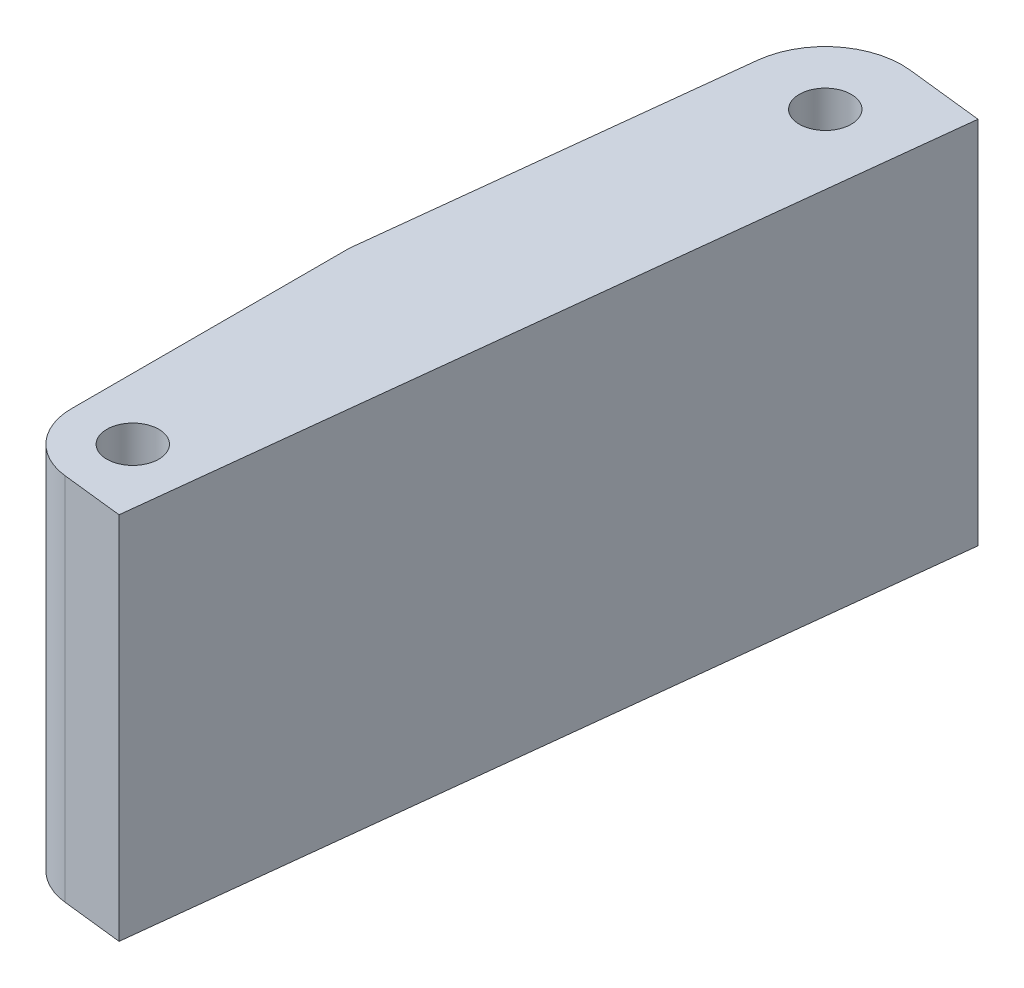
ISO-10303-21;
HEADER;
FILE_DESCRIPTION(('STEP AP214'),'2;1');
FILE_NAME('part.step','',(''),(''),'','','');
FILE_SCHEMA(('AUTOMOTIVE_DESIGN { 1 0 10303 214 1 1 1 1 }'));
ENDSEC;
DATA;
#1=APPLICATION_CONTEXT('core data for automotive mechanical design processes');
#2=APPLICATION_PROTOCOL_DEFINITION('international standard','automotive_design',2000,#1);
#3=PRODUCT_CONTEXT('',#1,'mechanical');
#4=PRODUCT('Part','Part','',(#3));
#5=PRODUCT_RELATED_PRODUCT_CATEGORY('part','',(#4));
#6=PRODUCT_DEFINITION_FORMATION('','',#4);
#7=PRODUCT_DEFINITION_CONTEXT('part definition',#1,'design');
#8=PRODUCT_DEFINITION('design','',#6,#7);
#9=PRODUCT_DEFINITION_SHAPE('','',#8);
#10=(LENGTH_UNIT() NAMED_UNIT(*) SI_UNIT(.MILLI.,.METRE.));
#11=(NAMED_UNIT(*) PLANE_ANGLE_UNIT() SI_UNIT($,.RADIAN.));
#12=(NAMED_UNIT(*) SI_UNIT($,.STERADIAN.) SOLID_ANGLE_UNIT());
#13=UNCERTAINTY_MEASURE_WITH_UNIT(LENGTH_MEASURE(1.E-05),#10,'distance_accuracy_value','');
#14=(GEOMETRIC_REPRESENTATION_CONTEXT(3) GLOBAL_UNCERTAINTY_ASSIGNED_CONTEXT((#13)) GLOBAL_UNIT_ASSIGNED_CONTEXT((#10,
#11,#12)) REPRESENTATION_CONTEXT('',''));
#15=CARTESIAN_POINT('',(0.,0.,0.));
#16=DIRECTION('',(0.,0.,1.));
#17=DIRECTION('',(1.,0.,0.));
#18=AXIS2_PLACEMENT_3D('',#15,#16,#17);
#19=CARTESIAN_POINT('',(7.6200000000016,0.,108.613413739759));
#20=DIRECTION('',(-1.,0.,0.));
#21=DIRECTION('',(0.,0.,1.));
#22=AXIS2_PLACEMENT_3D('',#19,#20,#21);
#23=PLANE('',#22);
#24=DIRECTION('',(0.,0.,-1.));
#25=VECTOR('',#24,1.);
#26=CARTESIAN_POINT('',(7.6200000000016,15.2624999999999,81.9598120914848));
#27=LINE('',#26,#25);
#28=CARTESIAN_POINT('',(7.6200000000016,15.2624999999999,108.613413739759));
#29=VERTEX_POINT('',#28);
#30=CARTESIAN_POINT('',(7.62000000000169,15.2624999999999,85.6216230526508));
#31=VERTEX_POINT('',#30);
#32=EDGE_CURVE('E92',#29,#31,#27,.T.);
#33=ORIENTED_EDGE('',*,*,#32,.T.);
#34=DIRECTION('',(0.,1.,0.));
#35=VECTOR('',#34,1.);
#36=CARTESIAN_POINT('',(7.62000000000188,0.,85.6216230526492));
#37=LINE('',#36,#35);
#38=CARTESIAN_POINT('',(7.62000000000188,-15.2624999999999,85.6216230526492));
#39=VERTEX_POINT('',#38);
#40=EDGE_CURVE('E165',#39,#31,#37,.T.);
#41=ORIENTED_EDGE('',*,*,#40,.F.);
#42=DIRECTION('',(0.,0.,1.));
#43=VECTOR('',#42,1.);
#44=CARTESIAN_POINT('',(7.62000000000188,-15.2624999999999,81.9598120914848));
#45=LINE('',#44,#43);
#46=CARTESIAN_POINT('',(7.62000000000174,-15.2624999999999,108.613413739759));
#47=VERTEX_POINT('',#46);
#48=EDGE_CURVE('E124',#39,#47,#45,.T.);
#49=ORIENTED_EDGE('',*,*,#48,.T.);
#50=DIRECTION('',(0.,-1.,0.));
#51=VECTOR('',#50,1.);
#52=CARTESIAN_POINT('',(7.6200000000016,0.,108.613413739759));
#53=LINE('',#52,#51);
#54=EDGE_CURVE('E84',#29,#47,#53,.T.);
#55=ORIENTED_EDGE('',*,*,#54,.F.);
#56=EDGE_LOOP('',(#33,#41,#49,#55));
#57=FACE_BOUND('',#56,.T.);
#58=ADVANCED_FACE('F17',(#57),#23,.T.);
#59=CARTESIAN_POINT('',(7.62000000000188,0.,85.6216230526492));
#60=DIRECTION('',(-0.993723873054748,0.,-0.111860914179491));
#61=DIRECTION('',(-0.111860914179491,0.,0.993723873054748));
#62=AXIS2_PLACEMENT_3D('',#59,#60,#61);
#63=PLANE('',#62);
#64=DIRECTION('',(0.111860912463582,0.,-0.993723873247903));
#65=VECTOR('',#64,1.);
#66=CARTESIAN_POINT('',(7.62000000000188,15.2624999999999,85.6216230526492));
#67=LINE('',#66,#65);
#68=CARTESIAN_POINT('',(11.0299029436318,15.2624999999999,55.3295229265527));
#69=VERTEX_POINT('',#68);
#70=EDGE_CURVE('E120',#31,#69,#67,.T.);
#71=ORIENTED_EDGE('',*,*,#70,.T.);
#72=DIRECTION('',(0.,-1.,0.));
#73=VECTOR('',#72,1.);
#74=CARTESIAN_POINT('',(11.0299029445429,0.,55.3295229184585));
#75=LINE('',#74,#73);
#76=CARTESIAN_POINT('',(11.0299029436318,-15.2624999999999,55.3295229265527));
#77=VERTEX_POINT('',#76);
#78=EDGE_CURVE('E160',#77,#69,#75,.F.);
#79=ORIENTED_EDGE('',*,*,#78,.F.);
#80=DIRECTION('',(-0.111860912463582,0.,0.993723873247903));
#81=VECTOR('',#80,1.);
#82=CARTESIAN_POINT('',(11.0299029445429,-15.2624999999999,55.3295229184585));
#83=LINE('',#82,#81);
#84=EDGE_CURVE('E81',#77,#39,#83,.T.);
#85=ORIENTED_EDGE('',*,*,#84,.T.);
#86=ORIENTED_EDGE('',*,*,#40,.T.);
#87=EDGE_LOOP('',(#71,#79,#85,#86));
#88=FACE_BOUND('',#87,.T.);
#89=ADVANCED_FACE('F169',(#88),#63,.T.);
#90=CARTESIAN_POINT('',(17.3400495431374,0.,56.0398397293865));
#91=DIRECTION('',(0.,-1.,0.));
#92=DIRECTION('',(0.,0.,-1.));
#93=AXIS2_PLACEMENT_3D('',#90,#91,#92);
#94=CYLINDRICAL_SURFACE('',#93,6.35000000532595);
#95=CARTESIAN_POINT('',(17.3400495431374,15.2624999999999,56.0398397293865));
#96=DIRECTION('',(0.,-1.,0.));
#97=DIRECTION('',(0.,0.,-1.));
#98=AXIS2_PLACEMENT_3D('',#95,#96,#97);
#99=CIRCLE('',#98,6.35000000532595);
#100=CARTESIAN_POINT('',(18.05036637228,15.2624999999999,49.7296931328423));
#101=VERTEX_POINT('',#100);
#102=EDGE_CURVE('E89',#69,#101,#99,.T.);
#103=ORIENTED_EDGE('',*,*,#102,.T.);
#104=DIRECTION('',(0.,1.,0.));
#105=VECTOR('',#104,1.);
#106=CARTESIAN_POINT('',(18.0503663957872,0.,49.7296931354885));
#107=LINE('',#106,#105);
#108=CARTESIAN_POINT('',(18.05036637228,-15.2624999999999,49.7296931328423));
#109=VERTEX_POINT('',#108);
#110=EDGE_CURVE('E86',#109,#101,#107,.T.);
#111=ORIENTED_EDGE('',*,*,#110,.F.);
#112=CARTESIAN_POINT('',(17.3400495431374,-15.2624999999999,56.0398397293865));
#113=DIRECTION('',(0.,-1.,0.));
#114=DIRECTION('',(0.,0.,-1.));
#115=AXIS2_PLACEMENT_3D('',#112,#113,#114);
#116=CIRCLE('',#115,6.35000000532595);
#117=EDGE_CURVE('E20',#109,#77,#116,.F.);
#118=ORIENTED_EDGE('',*,*,#117,.T.);
#119=ORIENTED_EDGE('',*,*,#78,.T.);
#120=EDGE_LOOP('',(#103,#111,#118,#119));
#121=FACE_BOUND('',#120,.T.);
#122=ADVANCED_FACE('F87',(#121),#94,.T.);
#123=CARTESIAN_POINT('',(12.7000000000016,-3.27250000000012,108.613413739759));
#124=DIRECTION('',(0.,-1.,0.));
#125=DIRECTION('',(0.,0.,-1.));
#126=AXIS2_PLACEMENT_3D('',#123,#124,#125);
#127=CYLINDRICAL_SURFACE('',#126,2.1463);
#128=CARTESIAN_POINT('',(12.7000000000016,-15.2624999999999,108.613413739759));
#129=DIRECTION('',(0.,-1.,0.));
#130=DIRECTION('',(0.,0.,-1.));
#131=AXIS2_PLACEMENT_3D('',#128,#129,#130);
#132=CIRCLE('',#131,2.1463);
#133=CARTESIAN_POINT('',(12.7000000000016,-15.2624999999999,106.467113739759));
#134=VERTEX_POINT('',#133);
#135=EDGE_CURVE('E101',#134,#134,#132,.T.);
#136=ORIENTED_EDGE('',*,*,#135,.T.);
#137=EDGE_LOOP('',(#136));
#138=FACE_BOUND('',#137,.T.);
#139=CARTESIAN_POINT('',(12.7000000000016,15.2624999999999,108.613413739759));
#140=DIRECTION('',(0.,-1.,0.));
#141=DIRECTION('',(0.,0.,-1.));
#142=AXIS2_PLACEMENT_3D('',#139,#140,#141);
#143=CIRCLE('',#142,2.1463);
#144=CARTESIAN_POINT('',(12.7000000000016,15.2624999999999,106.467113739759));
#145=VERTEX_POINT('',#144);
#146=EDGE_CURVE('E113',#145,#145,#143,.F.);
#147=ORIENTED_EDGE('',*,*,#146,.T.);
#148=EDGE_LOOP('',(#147));
#149=FACE_BOUND('',#148,.T.);
#150=ADVANCED_FACE('F209',(#138,#149),#127,.F.);
#151=CARTESIAN_POINT('',(17.3400495907476,-3.27250000000012,56.0398397293865));
#152=DIRECTION('',(0.,-1.,0.));
#153=DIRECTION('',(0.,0.,-1.));
#154=AXIS2_PLACEMENT_3D('',#151,#152,#153);
#155=CYLINDRICAL_SURFACE('',#154,2.1463);
#156=CARTESIAN_POINT('',(17.3400495907476,-15.2624999999999,56.0398397293865));
#157=DIRECTION('',(0.,-1.,0.));
#158=DIRECTION('',(0.,0.,-1.));
#159=AXIS2_PLACEMENT_3D('',#156,#157,#158);
#160=CIRCLE('',#159,2.1463);
#161=CARTESIAN_POINT('',(17.3400495907476,-15.2624999999999,53.8935397293865));
#162=VERTEX_POINT('',#161);
#163=EDGE_CURVE('E98',#162,#162,#160,.T.);
#164=ORIENTED_EDGE('',*,*,#163,.T.);
#165=EDGE_LOOP('',(#164));
#166=FACE_BOUND('',#165,.T.);
#167=CARTESIAN_POINT('',(17.3400495907476,15.2624999999999,56.0398397293865));
#168=DIRECTION('',(0.,-1.,0.));
#169=DIRECTION('',(0.,0.,-1.));
#170=AXIS2_PLACEMENT_3D('',#167,#168,#169);
#171=CIRCLE('',#170,2.1463);
#172=CARTESIAN_POINT('',(17.3400495907476,15.2624999999999,53.8935397293865));
#173=VERTEX_POINT('',#172);
#174=EDGE_CURVE('E109',#173,#173,#171,.F.);
#175=ORIENTED_EDGE('',*,*,#174,.T.);
#176=EDGE_LOOP('',(#175));
#177=FACE_BOUND('',#176,.T.);
#178=ADVANCED_FACE('F206',(#166,#177),#155,.F.);
#179=CARTESIAN_POINT('',(12.7000000000016,0.,108.613413739759));
#180=DIRECTION('',(0.,-1.,0.));
#181=DIRECTION('',(0.,0.,-1.));
#182=AXIS2_PLACEMENT_3D('',#179,#180,#181);
#183=CYLINDRICAL_SURFACE('',#182,5.08);
#184=CARTESIAN_POINT('',(12.7000000000016,15.2624999999999,108.613413739759));
#185=DIRECTION('',(0.,-1.,0.));
#186=DIRECTION('',(0.,0.,-1.));
#187=AXIS2_PLACEMENT_3D('',#184,#185,#186);
#188=CIRCLE('',#187,5.08);
#189=CARTESIAN_POINT('',(12.1317465559699,15.2624999999999,113.661531014877));
#190=VERTEX_POINT('',#189);
#191=EDGE_CURVE('E116',#190,#29,#188,.T.);
#192=ORIENTED_EDGE('',*,*,#191,.T.);
#193=ORIENTED_EDGE('',*,*,#54,.T.);
#194=CARTESIAN_POINT('',(12.7000000000016,-15.2624999999999,108.613413739759));
#195=DIRECTION('',(0.,-1.,0.));
#196=DIRECTION('',(0.,0.,-1.));
#197=AXIS2_PLACEMENT_3D('',#194,#195,#196);
#198=CIRCLE('',#197,5.08);
#199=CARTESIAN_POINT('',(12.1317465559699,-15.2624999999999,113.661531014877));
#200=VERTEX_POINT('',#199);
#201=EDGE_CURVE('E123',#47,#200,#198,.F.);
#202=ORIENTED_EDGE('',*,*,#201,.T.);
#203=DIRECTION('',(0.,1.,0.));
#204=VECTOR('',#203,1.);
#205=CARTESIAN_POINT('',(12.1317465559699,0.,113.661531014877));
#206=LINE('',#205,#204);
#207=EDGE_CURVE('E140',#190,#200,#206,.F.);
#208=ORIENTED_EDGE('',*,*,#207,.F.);
#209=EDGE_LOOP('',(#192,#193,#202,#208));
#210=FACE_BOUND('',#209,.T.);
#211=ADVANCED_FACE('F183',(#210),#183,.T.);
#212=CARTESIAN_POINT('',(15.9902564948433,-15.2624999999999,81.9598120914848));
#213=DIRECTION('',(0.,1.,0.));
#214=DIRECTION('',(0.,0.,1.));
#215=AXIS2_PLACEMENT_3D('',#212,#213,#214);
#216=PLANE('',#215);
#217=ORIENTED_EDGE('',*,*,#163,.F.);
#218=EDGE_LOOP('',(#217));
#219=FACE_BOUND('',#218,.T.);
#220=ORIENTED_EDGE('',*,*,#135,.F.);
#221=EDGE_LOOP('',(#220));
#222=FACE_BOUND('',#221,.T.);
#223=DIRECTION('',(0.993723873054751,0.,0.111860914179463));
#224=VECTOR('',#223,1.);
#225=CARTESIAN_POINT('',(17.179863831088,-15.2624999999999,114.229784458909));
#226=LINE('',#225,#224);
#227=CARTESIAN_POINT('',(17.179863831088,-15.2624999999999,114.229784458909));
#228=VERTEX_POINT('',#227);
#229=EDGE_CURVE('E112',#200,#228,#226,.T.);
#230=ORIENTED_EDGE('',*,*,#229,.F.);
#231=ORIENTED_EDGE('',*,*,#201,.F.);
#232=ORIENTED_EDGE('',*,*,#48,.F.);
#233=ORIENTED_EDGE('',*,*,#84,.F.);
#234=ORIENTED_EDGE('',*,*,#117,.F.);
#235=DIRECTION('',(-0.99372387305475,0.,-0.111860914179472));
#236=VECTOR('',#235,1.);
#237=CARTESIAN_POINT('',(18.0503663957872,-15.2624999999999,49.7296931354885));
#238=LINE('',#237,#236);
#239=CARTESIAN_POINT('',(24.3605129896851,-15.2624999999999,50.4400099405282));
#240=VERTEX_POINT('',#239);
#241=EDGE_CURVE('E77',#240,#109,#238,.T.);
#242=ORIENTED_EDGE('',*,*,#241,.F.);
#243=DIRECTION('',(0.111860914179471,0.,-0.99372387305475));
#244=VECTOR('',#243,1.);
#245=CARTESIAN_POINT('',(24.3605129896851,-15.2624999999999,50.4400099405282));
#246=LINE('',#245,#244);
#247=EDGE_CURVE('E143',#228,#240,#246,.T.);
#248=ORIENTED_EDGE('',*,*,#247,.F.);
#249=EDGE_LOOP('',(#230,#231,#232,#233,#234,#242,#248));
#250=FACE_BOUND('',#249,.T.);
#251=ADVANCED_FACE('F75',(#219,#222,#250),#216,.F.);
#252=CARTESIAN_POINT('',(18.0503663957872,0.,49.7296931354885));
#253=DIRECTION('',(0.111860914179472,0.,-0.99372387305475));
#254=DIRECTION('',(-0.99372387305475,0.,-0.111860914179472));
#255=AXIS2_PLACEMENT_3D('',#252,#253,#254);
#256=PLANE('',#255);
#257=DIRECTION('',(0.993723873054749,0.,0.111860914179477));
#258=VECTOR('',#257,1.);
#259=CARTESIAN_POINT('',(18.0503663957872,15.2624999999999,49.7296931354885));
#260=LINE('',#259,#258);
#261=CARTESIAN_POINT('',(24.3605129896851,15.2624999999999,50.4400099405282));
#262=VERTEX_POINT('',#261);
#263=EDGE_CURVE('E119',#101,#262,#260,.T.);
#264=ORIENTED_EDGE('',*,*,#263,.T.);
#265=DIRECTION('',(0.,1.,0.));
#266=VECTOR('',#265,1.);
#267=CARTESIAN_POINT('',(24.3605129896851,0.,50.4400099405282));
#268=LINE('',#267,#266);
#269=EDGE_CURVE('E96',#240,#262,#268,.T.);
#270=ORIENTED_EDGE('',*,*,#269,.F.);
#271=ORIENTED_EDGE('',*,*,#241,.T.);
#272=ORIENTED_EDGE('',*,*,#110,.T.);
#273=EDGE_LOOP('',(#264,#270,#271,#272));
#274=FACE_BOUND('',#273,.T.);
#275=ADVANCED_FACE('F94',(#274),#256,.T.);
#276=CARTESIAN_POINT('',(15.9902564948433,15.2624999999999,81.9598120914848));
#277=DIRECTION('',(0.,-1.,0.));
#278=DIRECTION('',(0.,0.,-1.));
#279=AXIS2_PLACEMENT_3D('',#276,#277,#278);
#280=PLANE('',#279);
#281=ORIENTED_EDGE('',*,*,#174,.F.);
#282=EDGE_LOOP('',(#281));
#283=FACE_BOUND('',#282,.T.);
#284=ORIENTED_EDGE('',*,*,#146,.F.);
#285=EDGE_LOOP('',(#284));
#286=FACE_BOUND('',#285,.T.);
#287=DIRECTION('',(0.993723873054751,0.,0.111860914179463));
#288=VECTOR('',#287,1.);
#289=CARTESIAN_POINT('',(17.179863831088,15.2624999999999,114.229784458909));
#290=LINE('',#289,#288);
#291=CARTESIAN_POINT('',(17.179863831088,15.2624999999999,114.229784458909));
#292=VERTEX_POINT('',#291);
#293=EDGE_CURVE('E35',#292,#190,#290,.F.);
#294=ORIENTED_EDGE('',*,*,#293,.F.);
#295=DIRECTION('',(0.111860914179471,0.,-0.99372387305475));
#296=VECTOR('',#295,1.);
#297=CARTESIAN_POINT('',(24.3605129896851,15.2624999999999,50.4400099405282));
#298=LINE('',#297,#296);
#299=EDGE_CURVE('E26',#262,#292,#298,.F.);
#300=ORIENTED_EDGE('',*,*,#299,.F.);
#301=ORIENTED_EDGE('',*,*,#263,.F.);
#302=ORIENTED_EDGE('',*,*,#102,.F.);
#303=ORIENTED_EDGE('',*,*,#70,.F.);
#304=ORIENTED_EDGE('',*,*,#32,.F.);
#305=ORIENTED_EDGE('',*,*,#191,.F.);
#306=EDGE_LOOP('',(#294,#300,#301,#302,#303,#304,#305));
#307=FACE_BOUND('',#306,.T.);
#308=ADVANCED_FACE('F172',(#283,#286,#307),#280,.F.);
#309=CARTESIAN_POINT('',(17.179863831088,0.,114.229784458909));
#310=DIRECTION('',(-0.111860914179463,0.,0.993723873054751));
#311=DIRECTION('',(0.993723873054751,0.,0.111860914179463));
#312=AXIS2_PLACEMENT_3D('',#309,#310,#311);
#313=PLANE('',#312);
#314=ORIENTED_EDGE('',*,*,#293,.T.);
#315=ORIENTED_EDGE('',*,*,#207,.T.);
#316=ORIENTED_EDGE('',*,*,#229,.T.);
#317=DIRECTION('',(0.,1.,0.));
#318=VECTOR('',#317,1.);
#319=CARTESIAN_POINT('',(17.179863831088,0.,114.229784458909));
#320=LINE('',#319,#318);
#321=EDGE_CURVE('E11',#292,#228,#320,.F.);
#322=ORIENTED_EDGE('',*,*,#321,.F.);
#323=EDGE_LOOP('',(#314,#315,#316,#322));
#324=FACE_BOUND('',#323,.T.);
#325=ADVANCED_FACE('F182',(#324),#313,.T.);
#326=CARTESIAN_POINT('',(24.3605129896851,0.,50.4400099405282));
#327=DIRECTION('',(0.99372387305475,0.,0.111860914179471));
#328=DIRECTION('',(0.111860914179471,0.,-0.99372387305475));
#329=AXIS2_PLACEMENT_3D('',#326,#327,#328);
#330=PLANE('',#329);
#331=ORIENTED_EDGE('',*,*,#299,.T.);
#332=ORIENTED_EDGE('',*,*,#321,.T.);
#333=ORIENTED_EDGE('',*,*,#247,.T.);
#334=ORIENTED_EDGE('',*,*,#269,.T.);
#335=EDGE_LOOP('',(#331,#332,#333,#334));
#336=FACE_BOUND('',#335,.T.);
#337=ADVANCED_FACE('F180',(#336),#330,.T.);
#338=CLOSED_SHELL('',(#58,#89,#122,#150,#178,#211,#251,#275,#308,#325,#337));
#339=MANIFOLD_SOLID_BREP('B1',#338);
#340=ADVANCED_BREP_SHAPE_REPRESENTATION('',(#18,#339),#14);
#341=SHAPE_DEFINITION_REPRESENTATION(#9,#340);
ENDSEC;
END-ISO-10303-21;
